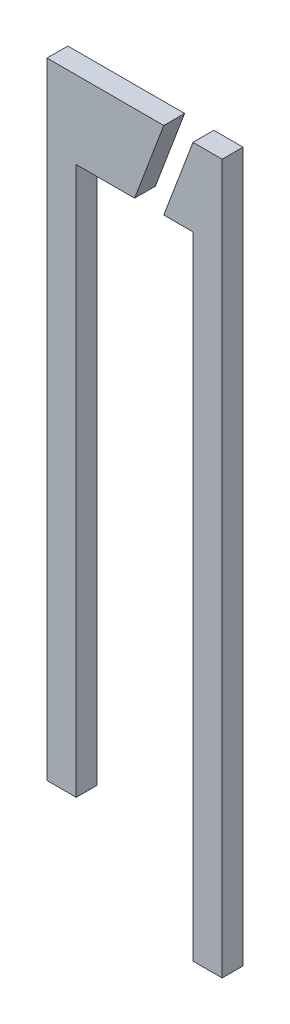
ISO-10303-21;
HEADER;
FILE_DESCRIPTION(('STEP AP214'),'2;1');
FILE_NAME('part.step','',(''),(''),'','','');
FILE_SCHEMA(('AUTOMOTIVE_DESIGN { 1 0 10303 214 1 1 1 1 }'));
ENDSEC;
DATA;
#1=APPLICATION_CONTEXT('core data for automotive mechanical design processes');
#2=APPLICATION_PROTOCOL_DEFINITION('international standard','automotive_design',2000,#1);
#3=PRODUCT_CONTEXT('',#1,'mechanical');
#4=PRODUCT('Part','Part','',(#3));
#5=PRODUCT_RELATED_PRODUCT_CATEGORY('part','',(#4));
#6=PRODUCT_DEFINITION_FORMATION('','',#4);
#7=PRODUCT_DEFINITION_CONTEXT('part definition',#1,'design');
#8=PRODUCT_DEFINITION('design','',#6,#7);
#9=PRODUCT_DEFINITION_SHAPE('','',#8);
#10=(LENGTH_UNIT() NAMED_UNIT(*) SI_UNIT(.MILLI.,.METRE.));
#11=(NAMED_UNIT(*) PLANE_ANGLE_UNIT() SI_UNIT($,.RADIAN.));
#12=(NAMED_UNIT(*) SI_UNIT($,.STERADIAN.) SOLID_ANGLE_UNIT());
#13=UNCERTAINTY_MEASURE_WITH_UNIT(LENGTH_MEASURE(1.E-05),#10,'distance_accuracy_value','');
#14=(GEOMETRIC_REPRESENTATION_CONTEXT(3) GLOBAL_UNCERTAINTY_ASSIGNED_CONTEXT((#13)) GLOBAL_UNIT_ASSIGNED_CONTEXT((#10,
#11,#12)) REPRESENTATION_CONTEXT('',''));
#15=CARTESIAN_POINT('',(0.,0.,0.));
#16=DIRECTION('',(0.,0.,1.));
#17=DIRECTION('',(1.,0.,0.));
#18=AXIS2_PLACEMENT_3D('',#15,#16,#17);
#19=CARTESIAN_POINT('',(-2.1,5.28364116094987,0.5));
#20=DIRECTION('',(1.,0.,0.));
#21=DIRECTION('',(0.,1.,0.));
#22=AXIS2_PLACEMENT_3D('',#19,#20,#21);
#23=PLANE('',#22);
#24=DIRECTION('',(0.,-1.,0.));
#25=VECTOR('',#24,1.);
#26=CARTESIAN_POINT('',(-2.1,5.28364116094987,0.));
#27=LINE('',#26,#25);
#28=CARTESIAN_POINT('',(-2.1,5.28364116094987,0.));
#29=VERTEX_POINT('',#28);
#30=CARTESIAN_POINT('',(-2.1,-9.71635883905013,0.));
#31=VERTEX_POINT('',#30);
#32=EDGE_CURVE('E127',#29,#31,#27,.T.);
#33=ORIENTED_EDGE('',*,*,#32,.T.);
#34=DIRECTION('',(0.,0.,-1.));
#35=VECTOR('',#34,1.);
#36=CARTESIAN_POINT('',(-2.1,-9.71635883905013,0.5));
#37=LINE('',#36,#35);
#38=CARTESIAN_POINT('',(-2.1,-9.71635883905013,0.5));
#39=VERTEX_POINT('',#38);
#40=EDGE_CURVE('E12',#39,#31,#37,.T.);
#41=ORIENTED_EDGE('',*,*,#40,.F.);
#42=DIRECTION('',(0.,-1.,0.));
#43=VECTOR('',#42,1.);
#44=CARTESIAN_POINT('',(-2.1,5.28364116094987,0.5));
#45=LINE('',#44,#43);
#46=CARTESIAN_POINT('',(-2.1,5.28364116094987,0.5));
#47=VERTEX_POINT('',#46);
#48=EDGE_CURVE('E137',#47,#39,#45,.T.);
#49=ORIENTED_EDGE('',*,*,#48,.F.);
#50=DIRECTION('',(0.,0.,-1.));
#51=VECTOR('',#50,1.);
#52=CARTESIAN_POINT('',(-2.1,5.28364116094987,0.5));
#53=LINE('',#52,#51);
#54=EDGE_CURVE('E123',#47,#29,#53,.T.);
#55=ORIENTED_EDGE('',*,*,#54,.T.);
#56=EDGE_LOOP('',(#33,#41,#49,#55));
#57=FACE_BOUND('',#56,.T.);
#58=ADVANCED_FACE('F43',(#57),#23,.F.);
#59=CARTESIAN_POINT('',(-2.1,-9.71635883905013,0.5));
#60=DIRECTION('',(0.,1.,0.));
#61=DIRECTION('',(0.,0.,1.));
#62=AXIS2_PLACEMENT_3D('',#59,#60,#61);
#63=PLANE('',#62);
#64=DIRECTION('',(1.,0.,0.));
#65=VECTOR('',#64,1.);
#66=CARTESIAN_POINT('',(-2.1,-9.71635883905013,0.));
#67=LINE('',#66,#65);
#68=CARTESIAN_POINT('',(-1.4,-9.71635883905013,0.));
#69=VERTEX_POINT('',#68);
#70=EDGE_CURVE('E130',#31,#69,#67,.T.);
#71=ORIENTED_EDGE('',*,*,#70,.T.);
#72=DIRECTION('',(0.,0.,-1.));
#73=VECTOR('',#72,1.);
#74=CARTESIAN_POINT('',(-1.4,-9.71635883905013,0.5));
#75=LINE('',#74,#73);
#76=CARTESIAN_POINT('',(-1.4,-9.71635883905013,0.5));
#77=VERTEX_POINT('',#76);
#78=EDGE_CURVE('E51',#77,#69,#75,.T.);
#79=ORIENTED_EDGE('',*,*,#78,.F.);
#80=DIRECTION('',(1.,0.,0.));
#81=VECTOR('',#80,1.);
#82=CARTESIAN_POINT('',(-2.1,-9.71635883905013,0.5));
#83=LINE('',#82,#81);
#84=EDGE_CURVE('E96',#39,#77,#83,.T.);
#85=ORIENTED_EDGE('',*,*,#84,.F.);
#86=ORIENTED_EDGE('',*,*,#40,.T.);
#87=EDGE_LOOP('',(#71,#79,#85,#86));
#88=FACE_BOUND('',#87,.T.);
#89=ADVANCED_FACE('F161',(#88),#63,.F.);
#90=CARTESIAN_POINT('',(-1.4,-9.71635883905013,0.5));
#91=DIRECTION('',(-1.,0.,0.));
#92=DIRECTION('',(0.,-1.,0.));
#93=AXIS2_PLACEMENT_3D('',#90,#91,#92);
#94=PLANE('',#93);
#95=DIRECTION('',(0.,1.,0.));
#96=VECTOR('',#95,1.);
#97=CARTESIAN_POINT('',(-1.4,-9.71635883905013,0.));
#98=LINE('',#97,#96);
#99=CARTESIAN_POINT('',(-1.4,3.42348284960422,0.));
#100=VERTEX_POINT('',#99);
#101=EDGE_CURVE('E132',#69,#100,#98,.T.);
#102=ORIENTED_EDGE('',*,*,#101,.T.);
#103=DIRECTION('',(0.,0.,-1.));
#104=VECTOR('',#103,1.);
#105=CARTESIAN_POINT('',(-1.4,3.42348284960422,0.5));
#106=LINE('',#105,#104);
#107=CARTESIAN_POINT('',(-1.4,3.42348284960422,0.5));
#108=VERTEX_POINT('',#107);
#109=EDGE_CURVE('E118',#108,#100,#106,.T.);
#110=ORIENTED_EDGE('',*,*,#109,.F.);
#111=DIRECTION('',(0.,1.,0.));
#112=VECTOR('',#111,1.);
#113=CARTESIAN_POINT('',(-1.4,-9.71635883905013,0.5));
#114=LINE('',#113,#112);
#115=EDGE_CURVE('E109',#77,#108,#114,.T.);
#116=ORIENTED_EDGE('',*,*,#115,.F.);
#117=ORIENTED_EDGE('',*,*,#78,.T.);
#118=EDGE_LOOP('',(#102,#110,#116,#117));
#119=FACE_BOUND('',#118,.T.);
#120=ADVANCED_FACE('F143',(#119),#94,.F.);
#121=CARTESIAN_POINT('',(-1.4,3.42348284960422,0.5));
#122=DIRECTION('',(0.,1.,0.));
#123=DIRECTION('',(-1.,0.,0.));
#124=AXIS2_PLACEMENT_3D('',#121,#122,#123);
#125=PLANE('',#124);
#126=DIRECTION('',(1.,0.,0.));
#127=VECTOR('',#126,1.);
#128=CARTESIAN_POINT('',(-1.4,3.42348284960422,0.));
#129=LINE('',#128,#127);
#130=CARTESIAN_POINT('',(0.,3.42348284960422,0.));
#131=VERTEX_POINT('',#130);
#132=EDGE_CURVE('E117',#100,#131,#129,.T.);
#133=ORIENTED_EDGE('',*,*,#132,.T.);
#134=DIRECTION('',(0.,0.,-1.));
#135=VECTOR('',#134,1.);
#136=CARTESIAN_POINT('',(0.,3.42348284960422,0.5));
#137=LINE('',#136,#135);
#138=CARTESIAN_POINT('',(0.,3.42348284960422,0.5));
#139=VERTEX_POINT('',#138);
#140=EDGE_CURVE('E114',#139,#131,#137,.T.);
#141=ORIENTED_EDGE('',*,*,#140,.F.);
#142=DIRECTION('',(1.,0.,0.));
#143=VECTOR('',#142,1.);
#144=CARTESIAN_POINT('',(-1.4,3.42348284960422,0.5));
#145=LINE('',#144,#143);
#146=EDGE_CURVE('E103',#108,#139,#145,.T.);
#147=ORIENTED_EDGE('',*,*,#146,.F.);
#148=ORIENTED_EDGE('',*,*,#109,.T.);
#149=EDGE_LOOP('',(#133,#141,#147,#148));
#150=FACE_BOUND('',#149,.T.);
#151=ADVANCED_FACE('F115',(#150),#125,.F.);
#152=CARTESIAN_POINT('',(0.,3.42348284960422,0.5));
#153=DIRECTION('',(-0.935924837051757,0.35219980038274,0.));
#154=DIRECTION('',(-0.35219980038274,-0.935924837051757,0.));
#155=AXIS2_PLACEMENT_3D('',#152,#153,#154);
#156=PLANE('',#155);
#157=DIRECTION('',(0.35219980038274,0.935924837051757,0.));
#158=VECTOR('',#157,1.);
#159=CARTESIAN_POINT('',(0.,3.42348284960422,0.));
#160=LINE('',#159,#158);
#161=CARTESIAN_POINT('',(0.700000000000002,5.28364116094987,0.));
#162=VERTEX_POINT('',#161);
#163=EDGE_CURVE('E82',#131,#162,#160,.T.);
#164=ORIENTED_EDGE('',*,*,#163,.T.);
#165=DIRECTION('',(0.,0.,-1.));
#166=VECTOR('',#165,1.);
#167=CARTESIAN_POINT('',(0.700000000000002,5.28364116094987,0.5));
#168=LINE('',#167,#166);
#169=CARTESIAN_POINT('',(0.700000000000002,5.28364116094987,0.5));
#170=VERTEX_POINT('',#169);
#171=EDGE_CURVE('E119',#170,#162,#168,.T.);
#172=ORIENTED_EDGE('',*,*,#171,.F.);
#173=DIRECTION('',(0.35219980038274,0.935924837051757,0.));
#174=VECTOR('',#173,1.);
#175=CARTESIAN_POINT('',(0.,3.42348284960422,0.5));
#176=LINE('',#175,#174);
#177=EDGE_CURVE('E107',#139,#170,#176,.T.);
#178=ORIENTED_EDGE('',*,*,#177,.F.);
#179=ORIENTED_EDGE('',*,*,#140,.T.);
#180=EDGE_LOOP('',(#164,#172,#178,#179));
#181=FACE_BOUND('',#180,.T.);
#182=ADVANCED_FACE('F121',(#181),#156,.F.);
#183=CARTESIAN_POINT('',(0.700000000000002,5.28364116094987,0.5));
#184=DIRECTION('',(0.,-1.,0.));
#185=DIRECTION('',(0.,0.,-1.));
#186=AXIS2_PLACEMENT_3D('',#183,#184,#185);
#187=PLANE('',#186);
#188=DIRECTION('',(-1.,0.,0.));
#189=VECTOR('',#188,1.);
#190=CARTESIAN_POINT('',(0.700000000000002,5.28364116094987,0.));
#191=LINE('',#190,#189);
#192=EDGE_CURVE('E88',#162,#29,#191,.T.);
#193=ORIENTED_EDGE('',*,*,#192,.T.);
#194=ORIENTED_EDGE('',*,*,#54,.F.);
#195=DIRECTION('',(-1.,0.,0.));
#196=VECTOR('',#195,1.);
#197=CARTESIAN_POINT('',(0.700000000000002,5.28364116094987,0.5));
#198=LINE('',#197,#196);
#199=EDGE_CURVE('E59',#170,#47,#198,.T.);
#200=ORIENTED_EDGE('',*,*,#199,.F.);
#201=ORIENTED_EDGE('',*,*,#171,.T.);
#202=EDGE_LOOP('',(#193,#194,#200,#201));
#203=FACE_BOUND('',#202,.T.);
#204=ADVANCED_FACE('F150',(#203),#187,.F.);
#205=CARTESIAN_POINT('',(0.,0.,0.5));
#206=DIRECTION('',(0.,0.,1.));
#207=DIRECTION('',(1.,0.,0.));
#208=AXIS2_PLACEMENT_3D('',#205,#206,#207);
#209=PLANE('',#208);
#210=ORIENTED_EDGE('',*,*,#48,.T.);
#211=ORIENTED_EDGE('',*,*,#84,.T.);
#212=ORIENTED_EDGE('',*,*,#115,.T.);
#213=ORIENTED_EDGE('',*,*,#146,.T.);
#214=ORIENTED_EDGE('',*,*,#177,.T.);
#215=ORIENTED_EDGE('',*,*,#199,.T.);
#216=EDGE_LOOP('',(#210,#211,#212,#213,#214,#215));
#217=FACE_BOUND('',#216,.T.);
#218=ADVANCED_FACE('F105',(#217),#209,.T.);
#219=CARTESIAN_POINT('',(0.,0.,0.));
#220=DIRECTION('',(0.,0.,1.));
#221=DIRECTION('',(1.,0.,0.));
#222=AXIS2_PLACEMENT_3D('',#219,#220,#221);
#223=PLANE('',#222);
#224=ORIENTED_EDGE('',*,*,#32,.F.);
#225=ORIENTED_EDGE('',*,*,#192,.F.);
#226=ORIENTED_EDGE('',*,*,#163,.F.);
#227=ORIENTED_EDGE('',*,*,#132,.F.);
#228=ORIENTED_EDGE('',*,*,#101,.F.);
#229=ORIENTED_EDGE('',*,*,#70,.F.);
#230=EDGE_LOOP('',(#224,#225,#226,#227,#228,#229));
#231=FACE_BOUND('',#230,.T.);
#232=ADVANCED_FACE('F146',(#231),#223,.F.);
#233=CLOSED_SHELL('',(#58,#89,#120,#151,#182,#204,#218,#232));
#234=MANIFOLD_SOLID_BREP('B2',#233);
#235=CARTESIAN_POINT('',(2.1,5.28364116094987,0.5));
#236=DIRECTION('',(0.,-1.,0.));
#237=DIRECTION('',(0.,0.,-1.));
#238=AXIS2_PLACEMENT_3D('',#235,#236,#237);
#239=PLANE('',#238);
#240=DIRECTION('',(-1.,0.,0.));
#241=VECTOR('',#240,1.);
#242=CARTESIAN_POINT('',(2.1,5.28364116094987,0.));
#243=LINE('',#242,#241);
#244=CARTESIAN_POINT('',(2.1,5.28364116094987,0.));
#245=VERTEX_POINT('',#244);
#246=CARTESIAN_POINT('',(1.4,5.28364116094987,0.));
#247=VERTEX_POINT('',#246);
#248=EDGE_CURVE('E303',#245,#247,#243,.T.);
#249=ORIENTED_EDGE('',*,*,#248,.T.);
#250=DIRECTION('',(0.,0.,-1.));
#251=VECTOR('',#250,1.);
#252=CARTESIAN_POINT('',(1.4,5.28364116094987,0.5));
#253=LINE('',#252,#251);
#254=CARTESIAN_POINT('',(1.4,5.28364116094987,0.5));
#255=VERTEX_POINT('',#254);
#256=EDGE_CURVE('E41',#255,#247,#253,.T.);
#257=ORIENTED_EDGE('',*,*,#256,.F.);
#258=DIRECTION('',(-1.,0.,0.));
#259=VECTOR('',#258,1.);
#260=CARTESIAN_POINT('',(2.1,5.28364116094987,0.5));
#261=LINE('',#260,#259);
#262=CARTESIAN_POINT('',(2.1,5.28364116094987,0.5));
#263=VERTEX_POINT('',#262);
#264=EDGE_CURVE('E313',#263,#255,#261,.T.);
#265=ORIENTED_EDGE('',*,*,#264,.F.);
#266=DIRECTION('',(0.,0.,-1.));
#267=VECTOR('',#266,1.);
#268=CARTESIAN_POINT('',(2.1,5.28364116094987,0.5));
#269=LINE('',#268,#267);
#270=EDGE_CURVE('E299',#263,#245,#269,.T.);
#271=ORIENTED_EDGE('',*,*,#270,.T.);
#272=EDGE_LOOP('',(#249,#257,#265,#271));
#273=FACE_BOUND('',#272,.T.);
#274=ADVANCED_FACE('F219',(#273),#239,.F.);
#275=CARTESIAN_POINT('',(1.4,5.28364116094987,0.5));
#276=DIRECTION('',(0.935924837051757,-0.35219980038274,0.));
#277=DIRECTION('',(0.35219980038274,0.935924837051757,0.));
#278=AXIS2_PLACEMENT_3D('',#275,#276,#277);
#279=PLANE('',#278);
#280=DIRECTION('',(-0.35219980038274,-0.935924837051757,0.));
#281=VECTOR('',#280,1.);
#282=CARTESIAN_POINT('',(1.4,5.28364116094987,0.));
#283=LINE('',#282,#281);
#284=CARTESIAN_POINT('',(0.7,3.42348284960422,0.));
#285=VERTEX_POINT('',#284);
#286=EDGE_CURVE('E306',#247,#285,#283,.T.);
#287=ORIENTED_EDGE('',*,*,#286,.T.);
#288=DIRECTION('',(0.,0.,-1.));
#289=VECTOR('',#288,1.);
#290=CARTESIAN_POINT('',(0.7,3.42348284960422,0.5));
#291=LINE('',#290,#289);
#292=CARTESIAN_POINT('',(0.7,3.42348284960422,0.5));
#293=VERTEX_POINT('',#292);
#294=EDGE_CURVE('E227',#293,#285,#291,.T.);
#295=ORIENTED_EDGE('',*,*,#294,.F.);
#296=DIRECTION('',(-0.35219980038274,-0.935924837051757,0.));
#297=VECTOR('',#296,1.);
#298=CARTESIAN_POINT('',(1.4,5.28364116094987,0.5));
#299=LINE('',#298,#297);
#300=EDGE_CURVE('E272',#255,#293,#299,.T.);
#301=ORIENTED_EDGE('',*,*,#300,.F.);
#302=ORIENTED_EDGE('',*,*,#256,.T.);
#303=EDGE_LOOP('',(#287,#295,#301,#302));
#304=FACE_BOUND('',#303,.T.);
#305=ADVANCED_FACE('F337',(#304),#279,.F.);
#306=CARTESIAN_POINT('',(0.7,3.42348284960422,0.5));
#307=DIRECTION('',(0.,1.,0.));
#308=DIRECTION('',(0.,0.,1.));
#309=AXIS2_PLACEMENT_3D('',#306,#307,#308);
#310=PLANE('',#309);
#311=DIRECTION('',(1.,0.,0.));
#312=VECTOR('',#311,1.);
#313=CARTESIAN_POINT('',(0.7,3.42348284960422,0.));
#314=LINE('',#313,#312);
#315=CARTESIAN_POINT('',(1.4,3.42348284960422,0.));
#316=VERTEX_POINT('',#315);
#317=EDGE_CURVE('E308',#285,#316,#314,.T.);
#318=ORIENTED_EDGE('',*,*,#317,.T.);
#319=DIRECTION('',(0.,0.,-1.));
#320=VECTOR('',#319,1.);
#321=CARTESIAN_POINT('',(1.4,3.42348284960422,0.5));
#322=LINE('',#321,#320);
#323=CARTESIAN_POINT('',(1.4,3.42348284960422,0.5));
#324=VERTEX_POINT('',#323);
#325=EDGE_CURVE('E294',#324,#316,#322,.T.);
#326=ORIENTED_EDGE('',*,*,#325,.F.);
#327=DIRECTION('',(1.,0.,0.));
#328=VECTOR('',#327,1.);
#329=CARTESIAN_POINT('',(0.7,3.42348284960422,0.5));
#330=LINE('',#329,#328);
#331=EDGE_CURVE('E285',#293,#324,#330,.T.);
#332=ORIENTED_EDGE('',*,*,#331,.F.);
#333=ORIENTED_EDGE('',*,*,#294,.T.);
#334=EDGE_LOOP('',(#318,#326,#332,#333));
#335=FACE_BOUND('',#334,.T.);
#336=ADVANCED_FACE('F319',(#335),#310,.F.);
#337=CARTESIAN_POINT('',(1.4,3.42348284960422,0.5));
#338=DIRECTION('',(1.,0.,0.));
#339=DIRECTION('',(0.,1.,0.));
#340=AXIS2_PLACEMENT_3D('',#337,#338,#339);
#341=PLANE('',#340);
#342=DIRECTION('',(0.,-1.,0.));
#343=VECTOR('',#342,1.);
#344=CARTESIAN_POINT('',(1.4,3.42348284960422,0.));
#345=LINE('',#344,#343);
#346=CARTESIAN_POINT('',(1.4,-11.7163588390501,0.));
#347=VERTEX_POINT('',#346);
#348=EDGE_CURVE('E293',#316,#347,#345,.T.);
#349=ORIENTED_EDGE('',*,*,#348,.T.);
#350=DIRECTION('',(0.,0.,-1.));
#351=VECTOR('',#350,1.);
#352=CARTESIAN_POINT('',(1.4,-11.7163588390501,0.5));
#353=LINE('',#352,#351);
#354=CARTESIAN_POINT('',(1.4,-11.7163588390501,0.5));
#355=VERTEX_POINT('',#354);
#356=EDGE_CURVE('E290',#355,#347,#353,.T.);
#357=ORIENTED_EDGE('',*,*,#356,.F.);
#358=DIRECTION('',(0.,-1.,0.));
#359=VECTOR('',#358,1.);
#360=CARTESIAN_POINT('',(1.4,3.42348284960422,0.5));
#361=LINE('',#360,#359);
#362=EDGE_CURVE('E279',#324,#355,#361,.T.);
#363=ORIENTED_EDGE('',*,*,#362,.F.);
#364=ORIENTED_EDGE('',*,*,#325,.T.);
#365=EDGE_LOOP('',(#349,#357,#363,#364));
#366=FACE_BOUND('',#365,.T.);
#367=ADVANCED_FACE('F291',(#366),#341,.F.);
#368=CARTESIAN_POINT('',(1.4,-11.7163588390501,0.5));
#369=DIRECTION('',(0.,1.,0.));
#370=DIRECTION('',(0.,0.,1.));
#371=AXIS2_PLACEMENT_3D('',#368,#369,#370);
#372=PLANE('',#371);
#373=DIRECTION('',(1.,0.,0.));
#374=VECTOR('',#373,1.);
#375=CARTESIAN_POINT('',(1.4,-11.7163588390501,0.));
#376=LINE('',#375,#374);
#377=CARTESIAN_POINT('',(2.1,-11.7163588390501,0.));
#378=VERTEX_POINT('',#377);
#379=EDGE_CURVE('E258',#347,#378,#376,.T.);
#380=ORIENTED_EDGE('',*,*,#379,.T.);
#381=DIRECTION('',(0.,0.,-1.));
#382=VECTOR('',#381,1.);
#383=CARTESIAN_POINT('',(2.1,-11.7163588390501,0.5));
#384=LINE('',#383,#382);
#385=CARTESIAN_POINT('',(2.1,-11.7163588390501,0.5));
#386=VERTEX_POINT('',#385);
#387=EDGE_CURVE('E295',#386,#378,#384,.T.);
#388=ORIENTED_EDGE('',*,*,#387,.F.);
#389=DIRECTION('',(1.,0.,0.));
#390=VECTOR('',#389,1.);
#391=CARTESIAN_POINT('',(1.4,-11.7163588390501,0.5));
#392=LINE('',#391,#390);
#393=EDGE_CURVE('E283',#355,#386,#392,.T.);
#394=ORIENTED_EDGE('',*,*,#393,.F.);
#395=ORIENTED_EDGE('',*,*,#356,.T.);
#396=EDGE_LOOP('',(#380,#388,#394,#395));
#397=FACE_BOUND('',#396,.T.);
#398=ADVANCED_FACE('F297',(#397),#372,.F.);
#399=CARTESIAN_POINT('',(2.1,-11.7163588390501,0.5));
#400=DIRECTION('',(-1.,0.,0.));
#401=DIRECTION('',(0.,0.,1.));
#402=AXIS2_PLACEMENT_3D('',#399,#400,#401);
#403=PLANE('',#402);
#404=DIRECTION('',(0.,1.,0.));
#405=VECTOR('',#404,1.);
#406=CARTESIAN_POINT('',(2.1,-11.7163588390501,0.));
#407=LINE('',#406,#405);
#408=EDGE_CURVE('E264',#378,#245,#407,.T.);
#409=ORIENTED_EDGE('',*,*,#408,.T.);
#410=ORIENTED_EDGE('',*,*,#270,.F.);
#411=DIRECTION('',(0.,1.,0.));
#412=VECTOR('',#411,1.);
#413=CARTESIAN_POINT('',(2.1,-11.7163588390501,0.5));
#414=LINE('',#413,#412);
#415=EDGE_CURVE('E235',#386,#263,#414,.T.);
#416=ORIENTED_EDGE('',*,*,#415,.F.);
#417=ORIENTED_EDGE('',*,*,#387,.T.);
#418=EDGE_LOOP('',(#409,#410,#416,#417));
#419=FACE_BOUND('',#418,.T.);
#420=ADVANCED_FACE('F326',(#419),#403,.F.);
#421=CARTESIAN_POINT('',(0.,0.,0.5));
#422=DIRECTION('',(0.,0.,1.));
#423=DIRECTION('',(1.,0.,0.));
#424=AXIS2_PLACEMENT_3D('',#421,#422,#423);
#425=PLANE('',#424);
#426=ORIENTED_EDGE('',*,*,#264,.T.);
#427=ORIENTED_EDGE('',*,*,#300,.T.);
#428=ORIENTED_EDGE('',*,*,#331,.T.);
#429=ORIENTED_EDGE('',*,*,#362,.T.);
#430=ORIENTED_EDGE('',*,*,#393,.T.);
#431=ORIENTED_EDGE('',*,*,#415,.T.);
#432=EDGE_LOOP('',(#426,#427,#428,#429,#430,#431));
#433=FACE_BOUND('',#432,.T.);
#434=ADVANCED_FACE('F281',(#433),#425,.T.);
#435=CARTESIAN_POINT('',(0.,0.,0.));
#436=DIRECTION('',(0.,0.,1.));
#437=DIRECTION('',(1.,0.,0.));
#438=AXIS2_PLACEMENT_3D('',#435,#436,#437);
#439=PLANE('',#438);
#440=ORIENTED_EDGE('',*,*,#248,.F.);
#441=ORIENTED_EDGE('',*,*,#408,.F.);
#442=ORIENTED_EDGE('',*,*,#379,.F.);
#443=ORIENTED_EDGE('',*,*,#348,.F.);
#444=ORIENTED_EDGE('',*,*,#317,.F.);
#445=ORIENTED_EDGE('',*,*,#286,.F.);
#446=EDGE_LOOP('',(#440,#441,#442,#443,#444,#445));
#447=FACE_BOUND('',#446,.T.);
#448=ADVANCED_FACE('F322',(#447),#439,.F.);
#449=CLOSED_SHELL('',(#274,#305,#336,#367,#398,#420,#434,#448));
#450=MANIFOLD_SOLID_BREP('B6',#449);
#451=ADVANCED_BREP_SHAPE_REPRESENTATION('',(#18,#234,#450),#14);
#452=SHAPE_DEFINITION_REPRESENTATION(#9,#451);
ENDSEC;
END-ISO-10303-21;
